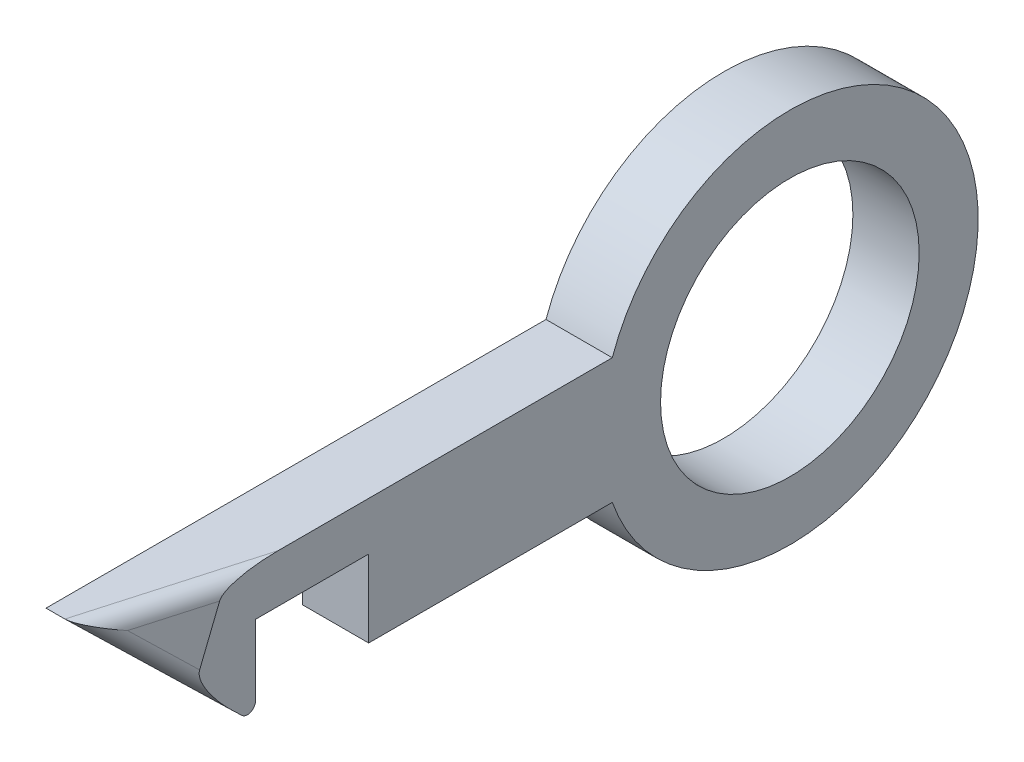
ISO-10303-21;
HEADER;
FILE_DESCRIPTION(('STEP AP214'),'2;1');
FILE_NAME('part.step','',(''),(''),'','','');
FILE_SCHEMA(('AUTOMOTIVE_DESIGN { 1 0 10303 214 1 1 1 1 }'));
ENDSEC;
DATA;
#1=APPLICATION_CONTEXT('core data for automotive mechanical design processes');
#2=APPLICATION_PROTOCOL_DEFINITION('international standard','automotive_design',2000,#1);
#3=PRODUCT_CONTEXT('',#1,'mechanical');
#4=PRODUCT('Part','Part','',(#3));
#5=PRODUCT_RELATED_PRODUCT_CATEGORY('part','',(#4));
#6=PRODUCT_DEFINITION_FORMATION('','',#4);
#7=PRODUCT_DEFINITION_CONTEXT('part definition',#1,'design');
#8=PRODUCT_DEFINITION('design','',#6,#7);
#9=PRODUCT_DEFINITION_SHAPE('','',#8);
#10=(LENGTH_UNIT() NAMED_UNIT(*) SI_UNIT(.MILLI.,.METRE.));
#11=(NAMED_UNIT(*) PLANE_ANGLE_UNIT() SI_UNIT($,.RADIAN.));
#12=(NAMED_UNIT(*) SI_UNIT($,.STERADIAN.) SOLID_ANGLE_UNIT());
#13=UNCERTAINTY_MEASURE_WITH_UNIT(LENGTH_MEASURE(1.E-05),#10,'distance_accuracy_value','');
#14=(GEOMETRIC_REPRESENTATION_CONTEXT(3) GLOBAL_UNCERTAINTY_ASSIGNED_CONTEXT((#13)) GLOBAL_UNIT_ASSIGNED_CONTEXT((#10,
#11,#12)) REPRESENTATION_CONTEXT('',''));
#15=CARTESIAN_POINT('',(0.,0.,0.));
#16=DIRECTION('',(0.,0.,1.));
#17=DIRECTION('',(1.,0.,0.));
#18=AXIS2_PLACEMENT_3D('',#15,#16,#17);
#19=CARTESIAN_POINT('',(4.1,4.64490969657858,-33.048252553421));
#20=DIRECTION('',(1.,0.,0.));
#21=DIRECTION('',(0.,0.,-1.));
#22=AXIS2_PLACEMENT_3D('',#19,#20,#21);
#23=PLANE('',#22);
#24=CARTESIAN_POINT('',(4.1,4.64490969657858,-33.048252553421));
#25=DIRECTION('',(1.,0.,0.));
#26=DIRECTION('',(0.,0.,-1.));
#27=AXIS2_PLACEMENT_3D('',#24,#25,#26);
#28=CIRCLE('',#27,8.);
#29=CARTESIAN_POINT('',(4.1,4.64490969657858,-41.048252553421));
#30=VERTEX_POINT('',#29);
#31=EDGE_CURVE('E234',#30,#30,#28,.T.);
#32=ORIENTED_EDGE('',*,*,#31,.F.);
#33=EDGE_LOOP('',(#32));
#34=FACE_BOUND('',#33,.T.);
#35=DIRECTION('',(0.,0.,1.));
#36=VECTOR('',#35,1.);
#37=CARTESIAN_POINT('',(4.1,8.51930515444542,8.86983730130517));
#38=LINE('',#37,#36);
#39=CARTESIAN_POINT('',(4.1,8.51930515444542,-22.061371292751));
#40=VERTEX_POINT('',#39);
#41=CARTESIAN_POINT('',(4.1,8.51930515444542,-1.38971479190022));
#42=VERTEX_POINT('',#41);
#43=EDGE_CURVE('E168',#40,#42,#38,.T.);
#44=ORIENTED_EDGE('',*,*,#43,.T.);
#45=CARTESIAN_POINT('',(4.1,7.51930515444542,-1.38971479190021));
#46=DIRECTION('',(1.,0.,0.));
#47=DIRECTION('',(0.,0.,-1.));
#48=AXIS2_PLACEMENT_3D('',#45,#46,#47);
#49=ELLIPSE('',#48,3.64005494464026,1.);
#50=CARTESIAN_POINT('',(4.1,7.62926768246086,2.22826588967206));
#51=VERTEX_POINT('',#50);
#52=EDGE_CURVE('E47',#42,#51,#49,.T.);
#53=ORIENTED_EDGE('',*,*,#52,.T.);
#54=DIRECTION('',(0.,-0.927606751707262,0.373558180458014));
#55=VECTOR('',#54,1.);
#56=CARTESIAN_POINT('',(4.1,17.2852100385916,-1.66029599339408));
#57=LINE('',#56,#55);
#58=CARTESIAN_POINT('',(4.1,4.55813136155333,3.46504871155776));
#59=VERTEX_POINT('',#58);
#60=EDGE_CURVE('E155',#51,#59,#57,.T.);
#61=ORIENTED_EDGE('',*,*,#60,.T.);
#62=CARTESIAN_POINT('',(4.1,2.13003448505021,0.780608075575374));
#63=DIRECTION('',(1.,0.,0.));
#64=DIRECTION('',(0.,0.693030180696668,0.720908571625795));
#65=AXIS2_PLACEMENT_3D('',#62,#63,#64);
#66=ELLIPSE('',#65,3.64005494464026,1.);
#67=CARTESIAN_POINT('',(4.1,1.40912591342442,1.47363825627204));
#68=VERTEX_POINT('',#67);
#69=EDGE_CURVE('E54',#59,#68,#66,.T.);
#70=ORIENTED_EDGE('',*,*,#69,.T.);
#71=DIRECTION('',(0.,-0.693030180696668,-0.720908571625795));
#72=VECTOR('',#71,1.);
#73=CARTESIAN_POINT('',(4.1,0.000360070989405065,0.00820226298800781));
#74=LINE('',#73,#72);
#75=CARTESIAN_POINT('',(4.1,0.814139417104715,0.854717353336342));
#76=VERTEX_POINT('',#75);
#77=EDGE_CURVE('E241',#68,#76,#74,.T.);
#78=ORIENTED_EDGE('',*,*,#77,.T.);
#79=CARTESIAN_POINT('',(4.1,1.17459370291761,0.508202262988008));
#80=DIRECTION('',(1.,0.,0.));
#81=DIRECTION('',(0.,0.,-1.));
#82=AXIS2_PLACEMENT_3D('',#79,#80,#81);
#83=CIRCLE('',#82,0.5);
#84=CARTESIAN_POINT('',(4.1,1.17459370291761,0.00820226298800795));
#85=VERTEX_POINT('',#84);
#86=EDGE_CURVE('E122',#76,#85,#83,.T.);
#87=ORIENTED_EDGE('',*,*,#86,.T.);
#88=DIRECTION('',(0.,1.,0.));
#89=VECTOR('',#88,1.);
#90=CARTESIAN_POINT('',(4.1,5.53817988011676,0.00820226298800848));
#91=LINE('',#90,#89);
#92=CARTESIAN_POINT('',(4.1,5.53817988011676,0.00820226298800848));
#93=VERTEX_POINT('',#92);
#94=EDGE_CURVE('E116',#85,#93,#91,.T.);
#95=ORIENTED_EDGE('',*,*,#94,.T.);
#96=DIRECTION('',(0.,0.,-1.));
#97=VECTOR('',#96,1.);
#98=CARTESIAN_POINT('',(4.1,5.53817988011676,-6.99179773701199));
#99=LINE('',#98,#97);
#100=CARTESIAN_POINT('',(4.1,5.53817988011676,-6.99179773701199));
#101=VERTEX_POINT('',#100);
#102=EDGE_CURVE('E119',#93,#101,#99,.T.);
#103=ORIENTED_EDGE('',*,*,#102,.T.);
#104=DIRECTION('',(0.,-1.,0.));
#105=VECTOR('',#104,1.);
#106=CARTESIAN_POINT('',(4.1,5.53817988011676,-6.99179773701199));
#107=LINE('',#106,#105);
#108=CARTESIAN_POINT('',(4.1,0.769305154445424,-6.99179773701199));
#109=VERTEX_POINT('',#108);
#110=EDGE_CURVE('E136',#101,#109,#107,.T.);
#111=ORIENTED_EDGE('',*,*,#110,.T.);
#112=DIRECTION('',(0.,0.,-1.));
#113=VECTOR('',#112,1.);
#114=CARTESIAN_POINT('',(4.1,0.769305154445424,-6.99179773701199));
#115=LINE('',#114,#113);
#116=CARTESIAN_POINT('',(4.1,0.769305154445428,-22.061797737012));
#117=VERTEX_POINT('',#116);
#118=EDGE_CURVE('E265',#109,#117,#115,.T.);
#119=ORIENTED_EDGE('',*,*,#118,.T.);
#120=CARTESIAN_POINT('',(4.1,4.64490969657858,-33.048252553421));
#121=DIRECTION('',(1.,0.,0.));
#122=DIRECTION('',(0.,0.,-1.));
#123=AXIS2_PLACEMENT_3D('',#120,#121,#122);
#124=CIRCLE('',#123,11.65);
#125=EDGE_CURVE('E270',#117,#40,#124,.T.);
#126=ORIENTED_EDGE('',*,*,#125,.T.);
#127=EDGE_LOOP('',(#44,#53,#61,#70,#78,#87,#95,#103,#111,#119,#126));
#128=FACE_BOUND('',#127,.T.);
#129=ADVANCED_FACE('F38',(#34,#128),#23,.T.);
#130=CARTESIAN_POINT('',(0.,4.64490969657858,-33.048252553421));
#131=DIRECTION('',(1.,0.,0.));
#132=DIRECTION('',(0.,0.,-1.));
#133=AXIS2_PLACEMENT_3D('',#130,#131,#132);
#134=PLANE('',#133);
#135=DIRECTION('',(0.,1.,0.));
#136=VECTOR('',#135,1.);
#137=CARTESIAN_POINT('',(0.,5.53817988011676,0.00820226298800848));
#138=LINE('',#137,#136);
#139=CARTESIAN_POINT('',(0.,1.17459370291761,0.00820226298800795));
#140=VERTEX_POINT('',#139);
#141=CARTESIAN_POINT('',(0.,5.53817988011676,0.00820226298800848));
#142=VERTEX_POINT('',#141);
#143=EDGE_CURVE('E140',#140,#142,#138,.T.);
#144=ORIENTED_EDGE('',*,*,#143,.F.);
#145=CARTESIAN_POINT('',(0.,1.17459370291761,0.508202262988008));
#146=DIRECTION('',(1.,0.,0.));
#147=DIRECTION('',(0.,0.,-1.));
#148=AXIS2_PLACEMENT_3D('',#145,#146,#147);
#149=CIRCLE('',#148,0.5);
#150=CARTESIAN_POINT('',(0.,0.814139417104715,0.854717353336342));
#151=VERTEX_POINT('',#150);
#152=EDGE_CURVE('E144',#140,#151,#149,.F.);
#153=ORIENTED_EDGE('',*,*,#152,.T.);
#154=DIRECTION('',(0.,-0.693030180696668,-0.720908571625795));
#155=VECTOR('',#154,1.);
#156=CARTESIAN_POINT('',(0.,0.000360070989405065,0.00820226298800781));
#157=LINE('',#156,#155);
#158=CARTESIAN_POINT('',(0.,8.51930515444542,8.86983730130517));
#159=VERTEX_POINT('',#158);
#160=EDGE_CURVE('E127',#159,#151,#157,.T.);
#161=ORIENTED_EDGE('',*,*,#160,.F.);
#162=DIRECTION('',(0.,0.,1.));
#163=VECTOR('',#162,1.);
#164=CARTESIAN_POINT('',(0.,8.51930515444542,8.86983730130517));
#165=LINE('',#164,#163);
#166=CARTESIAN_POINT('',(0.,8.51930515444542,-22.061371292751));
#167=VERTEX_POINT('',#166);
#168=EDGE_CURVE('E249',#167,#159,#165,.T.);
#169=ORIENTED_EDGE('',*,*,#168,.F.);
#170=CARTESIAN_POINT('',(0.,4.64490969657858,-33.048252553421));
#171=DIRECTION('',(1.,0.,0.));
#172=DIRECTION('',(0.,0.,-1.));
#173=AXIS2_PLACEMENT_3D('',#170,#171,#172);
#174=CIRCLE('',#173,11.65);
#175=CARTESIAN_POINT('',(0.,0.769305154445428,-22.061797737012));
#176=VERTEX_POINT('',#175);
#177=EDGE_CURVE('E247',#176,#167,#174,.T.);
#178=ORIENTED_EDGE('',*,*,#177,.F.);
#179=DIRECTION('',(0.,0.,-1.));
#180=VECTOR('',#179,1.);
#181=CARTESIAN_POINT('',(0.,0.769305154445424,-6.99179773701199));
#182=LINE('',#181,#180);
#183=CARTESIAN_POINT('',(0.,0.769305154445424,-6.99179773701199));
#184=VERTEX_POINT('',#183);
#185=EDGE_CURVE('E245',#184,#176,#182,.T.);
#186=ORIENTED_EDGE('',*,*,#185,.F.);
#187=DIRECTION('',(0.,-1.,0.));
#188=VECTOR('',#187,1.);
#189=CARTESIAN_POINT('',(0.,5.53817988011676,-6.99179773701199));
#190=LINE('',#189,#188);
#191=CARTESIAN_POINT('',(0.,5.53817988011676,-6.99179773701199));
#192=VERTEX_POINT('',#191);
#193=EDGE_CURVE('E236',#192,#184,#190,.T.);
#194=ORIENTED_EDGE('',*,*,#193,.F.);
#195=DIRECTION('',(0.,0.,-1.));
#196=VECTOR('',#195,1.);
#197=CARTESIAN_POINT('',(0.,5.53817988011676,-6.99179773701199));
#198=LINE('',#197,#196);
#199=EDGE_CURVE('E233',#142,#192,#198,.T.);
#200=ORIENTED_EDGE('',*,*,#199,.F.);
#201=EDGE_LOOP('',(#144,#153,#161,#169,#178,#186,#194,#200));
#202=FACE_BOUND('',#201,.T.);
#203=CARTESIAN_POINT('',(0.,4.64490969657858,-33.048252553421));
#204=DIRECTION('',(1.,0.,0.));
#205=DIRECTION('',(0.,0.,-1.));
#206=AXIS2_PLACEMENT_3D('',#203,#204,#205);
#207=CIRCLE('',#206,8.);
#208=CARTESIAN_POINT('',(0.,4.64490969657858,-41.048252553421));
#209=VERTEX_POINT('',#208);
#210=EDGE_CURVE('E178',#209,#209,#207,.T.);
#211=ORIENTED_EDGE('',*,*,#210,.T.);
#212=EDGE_LOOP('',(#211));
#213=FACE_BOUND('',#212,.T.);
#214=ADVANCED_FACE('F187',(#202,#213),#134,.F.);
#215=CARTESIAN_POINT('',(4.1,5.53817988011676,0.00820226298800848));
#216=DIRECTION('',(0.,0.,1.));
#217=DIRECTION('',(0.,-1.,0.));
#218=AXIS2_PLACEMENT_3D('',#215,#216,#217);
#219=PLANE('',#218);
#220=ORIENTED_EDGE('',*,*,#94,.F.);
#221=DIRECTION('',(-1.,0.,0.));
#222=VECTOR('',#221,1.);
#223=CARTESIAN_POINT('',(4.1,1.17459370291761,0.00820226298800795));
#224=LINE('',#223,#222);
#225=EDGE_CURVE('E142',#85,#140,#224,.T.);
#226=ORIENTED_EDGE('',*,*,#225,.T.);
#227=ORIENTED_EDGE('',*,*,#143,.T.);
#228=DIRECTION('',(-1.,0.,0.));
#229=VECTOR('',#228,1.);
#230=CARTESIAN_POINT('',(4.1,5.53817988011676,0.00820226298800848));
#231=LINE('',#230,#229);
#232=EDGE_CURVE('E132',#93,#142,#231,.T.);
#233=ORIENTED_EDGE('',*,*,#232,.F.);
#234=EDGE_LOOP('',(#220,#226,#227,#233));
#235=FACE_BOUND('',#234,.T.);
#236=ADVANCED_FACE('F138',(#235),#219,.F.);
#237=CARTESIAN_POINT('',(4.1,5.53817988011676,-6.99179773701199));
#238=DIRECTION('',(0.,1.,0.));
#239=DIRECTION('',(0.,0.,1.));
#240=AXIS2_PLACEMENT_3D('',#237,#238,#239);
#241=PLANE('',#240);
#242=ORIENTED_EDGE('',*,*,#199,.T.);
#243=DIRECTION('',(-1.,0.,0.));
#244=VECTOR('',#243,1.);
#245=CARTESIAN_POINT('',(4.1,5.53817988011676,-6.99179773701199));
#246=LINE('',#245,#244);
#247=EDGE_CURVE('E134',#101,#192,#246,.T.);
#248=ORIENTED_EDGE('',*,*,#247,.F.);
#249=ORIENTED_EDGE('',*,*,#102,.F.);
#250=ORIENTED_EDGE('',*,*,#232,.T.);
#251=EDGE_LOOP('',(#242,#248,#249,#250));
#252=FACE_BOUND('',#251,.T.);
#253=ADVANCED_FACE('F131',(#252),#241,.F.);
#254=CARTESIAN_POINT('',(4.1,5.53817988011676,-6.99179773701199));
#255=DIRECTION('',(0.,0.,-1.));
#256=DIRECTION('',(0.,1.,0.));
#257=AXIS2_PLACEMENT_3D('',#254,#255,#256);
#258=PLANE('',#257);
#259=ORIENTED_EDGE('',*,*,#193,.T.);
#260=DIRECTION('',(-1.,0.,0.));
#261=VECTOR('',#260,1.);
#262=CARTESIAN_POINT('',(4.1,0.769305154445424,-6.99179773701199));
#263=LINE('',#262,#261);
#264=EDGE_CURVE('E146',#109,#184,#263,.T.);
#265=ORIENTED_EDGE('',*,*,#264,.F.);
#266=ORIENTED_EDGE('',*,*,#110,.F.);
#267=ORIENTED_EDGE('',*,*,#247,.T.);
#268=EDGE_LOOP('',(#259,#265,#266,#267));
#269=FACE_BOUND('',#268,.T.);
#270=ADVANCED_FACE('F213',(#269),#258,.F.);
#271=CARTESIAN_POINT('',(4.1,0.769305154445424,-6.99179773701199));
#272=DIRECTION('',(0.,1.,0.));
#273=DIRECTION('',(0.,0.,1.));
#274=AXIS2_PLACEMENT_3D('',#271,#272,#273);
#275=PLANE('',#274);
#276=ORIENTED_EDGE('',*,*,#185,.T.);
#277=DIRECTION('',(-1.,0.,0.));
#278=VECTOR('',#277,1.);
#279=CARTESIAN_POINT('',(4.1,0.769305154445428,-22.061797737012));
#280=LINE('',#279,#278);
#281=EDGE_CURVE('E258',#117,#176,#280,.T.);
#282=ORIENTED_EDGE('',*,*,#281,.F.);
#283=ORIENTED_EDGE('',*,*,#118,.F.);
#284=ORIENTED_EDGE('',*,*,#264,.T.);
#285=EDGE_LOOP('',(#276,#282,#283,#284));
#286=FACE_BOUND('',#285,.T.);
#287=ADVANCED_FACE('F209',(#286),#275,.F.);
#288=CARTESIAN_POINT('',(4.1,4.64490969657858,-33.048252553421));
#289=DIRECTION('',(-1.,0.,0.));
#290=DIRECTION('',(0.,0.,1.));
#291=AXIS2_PLACEMENT_3D('',#288,#289,#290);
#292=CYLINDRICAL_SURFACE('',#291,11.65);
#293=ORIENTED_EDGE('',*,*,#177,.T.);
#294=DIRECTION('',(-1.,0.,0.));
#295=VECTOR('',#294,1.);
#296=CARTESIAN_POINT('',(4.1,8.51930515444542,-22.061371292751));
#297=LINE('',#296,#295);
#298=EDGE_CURVE('E255',#40,#167,#297,.T.);
#299=ORIENTED_EDGE('',*,*,#298,.F.);
#300=ORIENTED_EDGE('',*,*,#125,.F.);
#301=ORIENTED_EDGE('',*,*,#281,.T.);
#302=EDGE_LOOP('',(#293,#299,#300,#301));
#303=FACE_BOUND('',#302,.T.);
#304=ADVANCED_FACE('F205',(#303),#292,.T.);
#305=CARTESIAN_POINT('',(4.1,8.51930515444542,8.86983730130517));
#306=DIRECTION('',(0.,-1.,0.));
#307=DIRECTION('',(0.,0.,-1.));
#308=AXIS2_PLACEMENT_3D('',#305,#306,#307);
#309=PLANE('',#308);
#310=DIRECTION('',(-1.,0.,0.));
#311=VECTOR('',#310,1.);
#312=CARTESIAN_POINT('',(4.1,8.51930515444542,8.86983730130517));
#313=LINE('',#312,#311);
#314=CARTESIAN_POINT('',(1.16869940194132,8.51930515444542,8.86983730130517));
#315=VERTEX_POINT('',#314);
#316=EDGE_CURVE('E253',#315,#159,#313,.T.);
#317=ORIENTED_EDGE('',*,*,#316,.F.);
#318=DIRECTION('',(-0.274721127897378,0.,0.961523947640823));
#319=VECTOR('',#318,1.);
#320=CARTESIAN_POINT('',(3.23898623953065,8.51930515444542,1.62383336974251));
#321=LINE('',#320,#319);
#322=EDGE_CURVE('E162',#315,#42,#321,.F.);
#323=ORIENTED_EDGE('',*,*,#322,.T.);
#324=ORIENTED_EDGE('',*,*,#43,.F.);
#325=ORIENTED_EDGE('',*,*,#298,.T.);
#326=ORIENTED_EDGE('',*,*,#168,.T.);
#327=EDGE_LOOP('',(#317,#323,#324,#325,#326));
#328=FACE_BOUND('',#327,.T.);
#329=ADVANCED_FACE('F202',(#328),#309,.F.);
#330=CARTESIAN_POINT('',(4.1,0.000360070989405065,0.00820226298800781));
#331=DIRECTION('',(0.,0.720908571625795,-0.693030180696668));
#332=DIRECTION('',(0.,0.693030180696668,0.720908571625795));
#333=AXIS2_PLACEMENT_3D('',#330,#331,#332);
#334=PLANE('',#333);
#335=ORIENTED_EDGE('',*,*,#77,.F.);
#336=DIRECTION('',(0.274721127897378,-0.666365115177693,-0.693170855677742));
#337=VECTOR('',#336,1.);
#338=CARTESIAN_POINT('',(1.23898623953065,8.34881700530246,8.692490958388));
#339=LINE('',#338,#337);
#340=EDGE_CURVE('E11',#68,#315,#339,.F.);
#341=ORIENTED_EDGE('',*,*,#340,.T.);
#342=ORIENTED_EDGE('',*,*,#316,.T.);
#343=ORIENTED_EDGE('',*,*,#160,.T.);
#344=DIRECTION('',(-1.,0.,0.));
#345=VECTOR('',#344,1.);
#346=CARTESIAN_POINT('',(4.1,0.814139417104715,0.854717353336342));
#347=LINE('',#346,#345);
#348=EDGE_CURVE('E151',#151,#76,#347,.F.);
#349=ORIENTED_EDGE('',*,*,#348,.T.);
#350=EDGE_LOOP('',(#335,#341,#342,#343,#349));
#351=FACE_BOUND('',#350,.T.);
#352=ADVANCED_FACE('F199',(#351),#334,.F.);
#353=CARTESIAN_POINT('',(4.1,4.64490969657858,-33.048252553421));
#354=DIRECTION('',(-1.,0.,0.));
#355=DIRECTION('',(0.,0.,1.));
#356=AXIS2_PLACEMENT_3D('',#353,#354,#355);
#357=CYLINDRICAL_SURFACE('',#356,8.);
#358=ORIENTED_EDGE('',*,*,#31,.T.);
#359=EDGE_LOOP('',(#358));
#360=FACE_BOUND('',#359,.T.);
#361=ORIENTED_EDGE('',*,*,#210,.F.);
#362=EDGE_LOOP('',(#361));
#363=FACE_BOUND('',#362,.T.);
#364=ADVANCED_FACE('F197',(#360,#363),#357,.F.);
#365=CARTESIAN_POINT('',(4.1,1.17459370291761,0.508202262988008));
#366=DIRECTION('',(-1.,0.,0.));
#367=DIRECTION('',(0.,0.,1.));
#368=AXIS2_PLACEMENT_3D('',#365,#366,#367);
#369=CYLINDRICAL_SURFACE('',#368,0.5);
#370=ORIENTED_EDGE('',*,*,#86,.F.);
#371=ORIENTED_EDGE('',*,*,#348,.F.);
#372=ORIENTED_EDGE('',*,*,#152,.F.);
#373=ORIENTED_EDGE('',*,*,#225,.F.);
#374=EDGE_LOOP('',(#370,#371,#372,#373));
#375=FACE_BOUND('',#374,.T.);
#376=ADVANCED_FACE('F184',(#375),#369,.T.);
#377=CARTESIAN_POINT('',(5.12797571879567,0.590027516793089,1.4651359196559));
#378=DIRECTION('',(0.955693010226633,0.109962528015434,0.273055145779038));
#379=DIRECTION('',(0.274721127897378,0.,-0.961523947640823));
#380=AXIS2_PLACEMENT_3D('',#377,#378,#379);
#381=PLANE('',#380);
#382=ORIENTED_EDGE('',*,*,#60,.F.);
#383=DIRECTION('',(-0.274721127897378,0.,0.961523947640823));
#384=VECTOR('',#383,1.);
#385=CARTESIAN_POINT('',(2.19467924975728,7.62926768246086,8.89688851552154));
#386=LINE('',#385,#384);
#387=CARTESIAN_POINT('',(2.83386824311573,7.62926768246086,6.659727038767));
#388=VERTEX_POINT('',#387);
#389=EDGE_CURVE('E159',#51,#388,#386,.T.);
#390=ORIENTED_EDGE('',*,*,#389,.T.);
#391=DIRECTION('',(0.274721127897378,-0.666365115177693,-0.693170855677742));
#392=VECTOR('',#391,1.);
#393=CARTESIAN_POINT('',(4.19467924975728,4.32847684006701,3.22615592208981));
#394=LINE('',#393,#392);
#395=EDGE_CURVE('E157',#388,#59,#394,.T.);
#396=ORIENTED_EDGE('',*,*,#395,.T.);
#397=EDGE_LOOP('',(#382,#390,#396));
#398=FACE_BOUND('',#397,.T.);
#399=ADVANCED_FACE('F173',(#398),#381,.T.);
#400=CARTESIAN_POINT('',(4.3291500625581,1.57420680263569,0.202421220571853));
#401=DIRECTION('',(-0.274721127897378,0.666365115177693,0.693170855677742));
#402=DIRECTION('',(0.,-0.720908571625795,0.693030180696668));
#403=AXIS2_PLACEMENT_3D('',#400,#401,#402);
#404=CYLINDRICAL_SURFACE('',#403,1.);
#405=ORIENTED_EDGE('',*,*,#69,.F.);
#406=ORIENTED_EDGE('',*,*,#395,.F.);
#407=CARTESIAN_POINT('',(1.87817523288909,7.51930515444542,6.38667189298795));
#408=DIRECTION('',(0.,0.927606751707262,-0.373558180458015));
#409=DIRECTION('',(-0.294365198697055,0.357006941976704,0.886507288845662));
#410=AXIS2_PLACEMENT_3D('',#407,#408,#409);
#411=ELLIPSE('',#410,2.78407957013148,1.);
#412=EDGE_CURVE('E42',#315,#388,#411,.T.);
#413=ORIENTED_EDGE('',*,*,#412,.F.);
#414=ORIENTED_EDGE('',*,*,#340,.F.);
#415=EDGE_LOOP('',(#405,#406,#413,#414));
#416=FACE_BOUND('',#415,.T.);
#417=ADVANCED_FACE('F40',(#416),#404,.T.);
#418=CARTESIAN_POINT('',(3.42347156440372,7.51930515444542,0.978134732686776));
#419=DIRECTION('',(0.274721127897378,0.,-0.961523947640823));
#420=DIRECTION('',(-0.961523947640823,0.,-0.274721127897378));
#421=AXIS2_PLACEMENT_3D('',#418,#419,#420);
#422=CYLINDRICAL_SURFACE('',#421,1.);
#423=ORIENTED_EDGE('',*,*,#52,.F.);
#424=ORIENTED_EDGE('',*,*,#322,.F.);
#425=ORIENTED_EDGE('',*,*,#412,.T.);
#426=ORIENTED_EDGE('',*,*,#389,.F.);
#427=EDGE_LOOP('',(#423,#424,#425,#426));
#428=FACE_BOUND('',#427,.T.);
#429=ADVANCED_FACE('F175',(#428),#422,.T.);
#430=CLOSED_SHELL('',(#129,#214,#236,#253,#270,#287,#304,#329,#352,#364,#376,#399,#417,#429));
#431=MANIFOLD_SOLID_BREP('B2',#430);
#432=ADVANCED_BREP_SHAPE_REPRESENTATION('',(#18,#431),#14);
#433=SHAPE_DEFINITION_REPRESENTATION(#9,#432);
ENDSEC;
END-ISO-10303-21;
